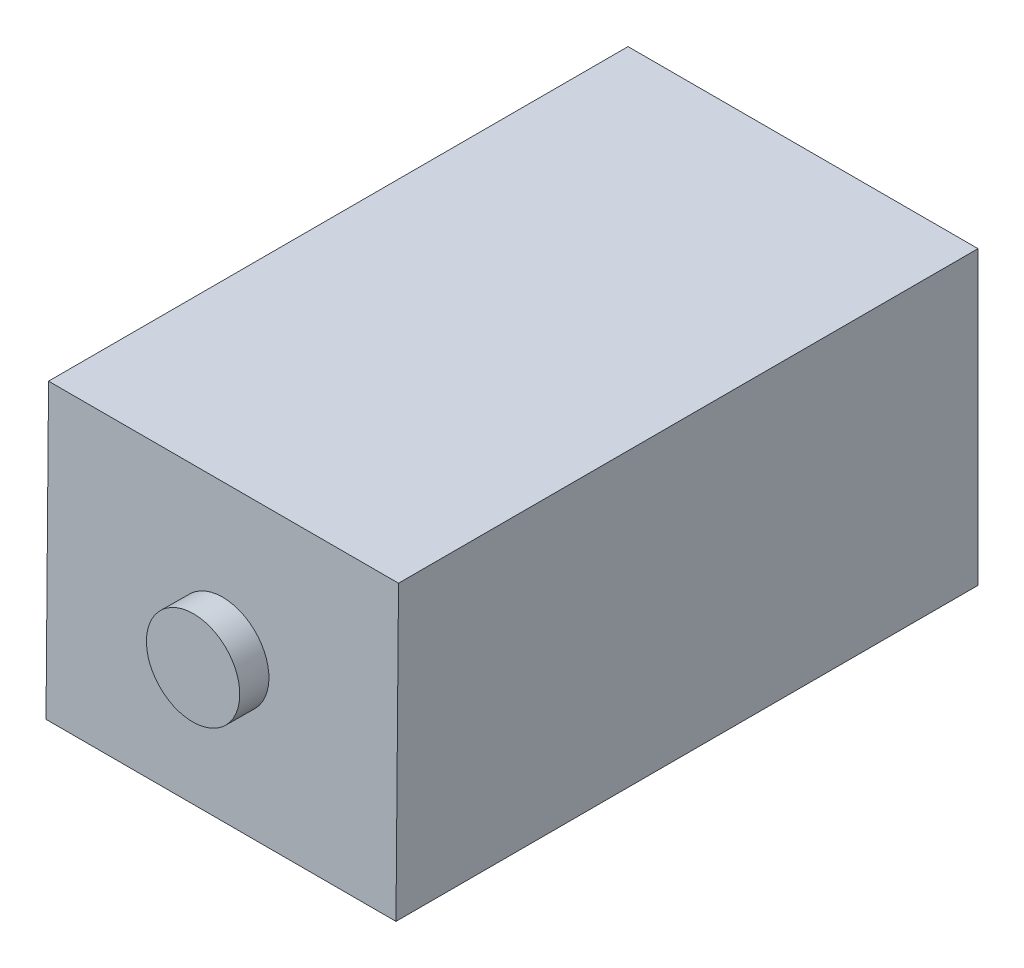
ISO-10303-21;
HEADER;
FILE_DESCRIPTION(('STEP AP214'),'2;1');
FILE_NAME('part.step','',(''),(''),'','','');
FILE_SCHEMA(('AUTOMOTIVE_DESIGN { 1 0 10303 214 1 1 1 1 }'));
ENDSEC;
DATA;
#1=APPLICATION_CONTEXT('core data for automotive mechanical design processes');
#2=APPLICATION_PROTOCOL_DEFINITION('international standard','automotive_design',2000,#1);
#3=PRODUCT_CONTEXT('',#1,'mechanical');
#4=PRODUCT('Part','Part','',(#3));
#5=PRODUCT_RELATED_PRODUCT_CATEGORY('part','',(#4));
#6=PRODUCT_DEFINITION_FORMATION('','',#4);
#7=PRODUCT_DEFINITION_CONTEXT('part definition',#1,'design');
#8=PRODUCT_DEFINITION('design','',#6,#7);
#9=PRODUCT_DEFINITION_SHAPE('','',#8);
#10=(LENGTH_UNIT() NAMED_UNIT(*) SI_UNIT(.MILLI.,.METRE.));
#11=(NAMED_UNIT(*) PLANE_ANGLE_UNIT() SI_UNIT($,.RADIAN.));
#12=(NAMED_UNIT(*) SI_UNIT($,.STERADIAN.) SOLID_ANGLE_UNIT());
#13=UNCERTAINTY_MEASURE_WITH_UNIT(LENGTH_MEASURE(1.E-05),#10,'distance_accuracy_value','');
#14=(GEOMETRIC_REPRESENTATION_CONTEXT(3) GLOBAL_UNCERTAINTY_ASSIGNED_CONTEXT((#13)) GLOBAL_UNIT_ASSIGNED_CONTEXT((#10,
#11,#12)) REPRESENTATION_CONTEXT('',''));
#15=CARTESIAN_POINT('',(0.,0.,0.));
#16=DIRECTION('',(0.,0.,1.));
#17=DIRECTION('',(1.,0.,0.));
#18=AXIS2_PLACEMENT_3D('',#15,#16,#17);
#19=CARTESIAN_POINT('',(-85.216834039375,12.4126394526767,-110.108323463438));
#20=DIRECTION('',(0.,-1.,0.));
#21=DIRECTION('',(0.,0.,-1.));
#22=AXIS2_PLACEMENT_3D('',#19,#20,#21);
#23=PLANE('',#22);
#24=DIRECTION('',(-1.,0.,0.));
#25=VECTOR('',#24,1.);
#26=CARTESIAN_POINT('',(190.,12.4126394526767,-160.));
#27=LINE('',#26,#25);
#28=CARTESIAN_POINT('',(-85.216834039375,12.4126394526767,-160.));
#29=VERTEX_POINT('',#28);
#30=CARTESIAN_POINT('',(-115.216834039375,12.4126394526767,-160.));
#31=VERTEX_POINT('',#30);
#32=EDGE_CURVE('E110',#29,#31,#27,.T.);
#33=ORIENTED_EDGE('',*,*,#32,.F.);
#34=DIRECTION('',(0.,0.,-1.));
#35=VECTOR('',#34,1.);
#36=CARTESIAN_POINT('',(-85.216834039375,12.4126394526767,-110.108323463438));
#37=LINE('',#36,#35);
#38=CARTESIAN_POINT('',(-85.216834039375,12.4126394526767,-110.108323463438));
#39=VERTEX_POINT('',#38);
#40=EDGE_CURVE('E11',#39,#29,#37,.T.);
#41=ORIENTED_EDGE('',*,*,#40,.F.);
#42=DIRECTION('',(-1.,0.,0.));
#43=VECTOR('',#42,1.);
#44=CARTESIAN_POINT('',(-135.,12.4126394526767,-110.108323463438));
#45=LINE('',#44,#43);
#46=CARTESIAN_POINT('',(-115.216834039375,12.4126394526767,-110.108323463438));
#47=VERTEX_POINT('',#46);
#48=EDGE_CURVE('E101',#47,#39,#45,.F.);
#49=ORIENTED_EDGE('',*,*,#48,.F.);
#50=DIRECTION('',(0.,0.,-1.));
#51=VECTOR('',#50,1.);
#52=CARTESIAN_POINT('',(-115.216834039375,12.4126394526767,-110.108323463438));
#53=LINE('',#52,#51);
#54=EDGE_CURVE('E48',#47,#31,#53,.T.);
#55=ORIENTED_EDGE('',*,*,#54,.T.);
#56=EDGE_LOOP('',(#33,#41,#49,#55));
#57=FACE_BOUND('',#56,.T.);
#58=ADVANCED_FACE('F39',(#57),#23,.T.);
#59=CARTESIAN_POINT('',(-85.216834039375,12.4126394526767,-110.108323463438));
#60=DIRECTION('',(1.,0.,0.));
#61=DIRECTION('',(0.,0.,-1.));
#62=AXIS2_PLACEMENT_3D('',#59,#60,#61);
#63=PLANE('',#62);
#64=DIRECTION('',(0.,-1.,0.));
#65=VECTOR('',#64,1.);
#66=CARTESIAN_POINT('',(-85.216834039375,125.,-160.));
#67=LINE('',#66,#65);
#68=CARTESIAN_POINT('',(-85.216834039375,37.411687529281,-160.));
#69=VERTEX_POINT('',#68);
#70=EDGE_CURVE('E107',#69,#29,#67,.T.);
#71=ORIENTED_EDGE('',*,*,#70,.F.);
#72=DIRECTION('',(0.,0.,-1.));
#73=VECTOR('',#72,1.);
#74=CARTESIAN_POINT('',(-85.216834039375,37.411687529281,-110.326486850897));
#75=LINE('',#74,#73);
#76=CARTESIAN_POINT('',(-85.216834039375,37.411687529281,-110.326486850897));
#77=VERTEX_POINT('',#76);
#78=EDGE_CURVE('E90',#77,#69,#75,.T.);
#79=ORIENTED_EDGE('',*,*,#78,.F.);
#80=DIRECTION('',(0.,-0.999961923064171,0.00872653549837395));
#81=VECTOR('',#80,1.);
#82=CARTESIAN_POINT('',(-85.216834039375,0.,-110.));
#83=LINE('',#82,#81);
#84=EDGE_CURVE('E97',#39,#77,#83,.F.);
#85=ORIENTED_EDGE('',*,*,#84,.F.);
#86=ORIENTED_EDGE('',*,*,#40,.T.);
#87=EDGE_LOOP('',(#71,#79,#85,#86));
#88=FACE_BOUND('',#87,.T.);
#89=ADVANCED_FACE('F143',(#88),#63,.T.);
#90=CARTESIAN_POINT('',(-115.216834039375,12.4126394526767,-110.108323463438));
#91=DIRECTION('',(-1.,0.,0.));
#92=DIRECTION('',(0.,0.,1.));
#93=AXIS2_PLACEMENT_3D('',#90,#91,#92);
#94=PLANE('',#93);
#95=DIRECTION('',(0.,1.,0.));
#96=VECTOR('',#95,1.);
#97=CARTESIAN_POINT('',(-115.216834039375,125.,-160.));
#98=LINE('',#97,#96);
#99=CARTESIAN_POINT('',(-115.216834039375,37.411687529281,-160.));
#100=VERTEX_POINT('',#99);
#101=EDGE_CURVE('E99',#31,#100,#98,.T.);
#102=ORIENTED_EDGE('',*,*,#101,.F.);
#103=ORIENTED_EDGE('',*,*,#54,.F.);
#104=DIRECTION('',(0.,0.999961923064171,-0.00872653549837395));
#105=VECTOR('',#104,1.);
#106=CARTESIAN_POINT('',(-115.216834039375,0.,-110.));
#107=LINE('',#106,#105);
#108=CARTESIAN_POINT('',(-115.216834039375,37.411687529281,-110.326486850897));
#109=VERTEX_POINT('',#108);
#110=EDGE_CURVE('E43',#109,#47,#107,.F.);
#111=ORIENTED_EDGE('',*,*,#110,.F.);
#112=DIRECTION('',(0.,0.,-1.));
#113=VECTOR('',#112,1.);
#114=CARTESIAN_POINT('',(-115.216834039375,37.411687529281,-110.326486850897));
#115=LINE('',#114,#113);
#116=EDGE_CURVE('E80',#109,#100,#115,.T.);
#117=ORIENTED_EDGE('',*,*,#116,.T.);
#118=EDGE_LOOP('',(#102,#103,#111,#117));
#119=FACE_BOUND('',#118,.T.);
#120=ADVANCED_FACE('F98',(#119),#94,.T.);
#121=CARTESIAN_POINT('',(-85.216834039375,37.411687529281,-110.326486850897));
#122=DIRECTION('',(0.,1.,0.));
#123=DIRECTION('',(0.,0.,1.));
#124=AXIS2_PLACEMENT_3D('',#121,#122,#123);
#125=PLANE('',#124);
#126=DIRECTION('',(1.,0.,0.));
#127=VECTOR('',#126,1.);
#128=CARTESIAN_POINT('',(190.,37.411687529281,-160.));
#129=LINE('',#128,#127);
#130=EDGE_CURVE('E85',#100,#69,#129,.T.);
#131=ORIENTED_EDGE('',*,*,#130,.F.);
#132=ORIENTED_EDGE('',*,*,#116,.F.);
#133=DIRECTION('',(1.,0.,0.));
#134=VECTOR('',#133,1.);
#135=CARTESIAN_POINT('',(-135.,37.411687529281,-110.326486850897));
#136=LINE('',#135,#134);
#137=EDGE_CURVE('E83',#77,#109,#136,.F.);
#138=ORIENTED_EDGE('',*,*,#137,.F.);
#139=ORIENTED_EDGE('',*,*,#78,.T.);
#140=EDGE_LOOP('',(#131,#132,#138,#139));
#141=FACE_BOUND('',#140,.T.);
#142=ADVANCED_FACE('F82',(#141),#125,.T.);
#143=CARTESIAN_POINT('',(190.,125.,-160.));
#144=DIRECTION('',(0.,0.,-1.));
#145=DIRECTION('',(-1.,0.,0.));
#146=AXIS2_PLACEMENT_3D('',#143,#144,#145);
#147=PLANE('',#146);
#148=ORIENTED_EDGE('',*,*,#32,.T.);
#149=ORIENTED_EDGE('',*,*,#101,.T.);
#150=ORIENTED_EDGE('',*,*,#130,.T.);
#151=ORIENTED_EDGE('',*,*,#70,.T.);
#152=EDGE_LOOP('',(#148,#149,#150,#151));
#153=FACE_BOUND('',#152,.T.);
#154=ADVANCED_FACE('F132',(#153),#147,.T.);
#155=CARTESIAN_POINT('',(-135.,0.,-110.));
#156=DIRECTION('',(0.,-0.00872653549837395,-0.999961923064171));
#157=DIRECTION('',(0.,0.999961923064171,-0.00872653549837395));
#158=AXIS2_PLACEMENT_3D('',#155,#156,#157);
#159=PLANE('',#158);
#160=CARTESIAN_POINT('',(-100.216834039375,24.9121634909788,-110.217405157168));
#161=DIRECTION('',(0.,-0.00872653549837395,-0.999961923064171));
#162=DIRECTION('',(0.,0.999961923064171,-0.00872653549837395));
#163=AXIS2_PLACEMENT_3D('',#160,#161,#162);
#164=CIRCLE('',#163,4.00000000000001);
#165=CARTESIAN_POINT('',(-100.216834039375,28.9120111832355,-110.252311299161));
#166=VERTEX_POINT('',#165);
#167=EDGE_CURVE('E91',#166,#166,#164,.T.);
#168=ORIENTED_EDGE('',*,*,#167,.T.);
#169=EDGE_LOOP('',(#168));
#170=FACE_BOUND('',#169,.T.);
#171=ORIENTED_EDGE('',*,*,#137,.T.);
#172=ORIENTED_EDGE('',*,*,#110,.T.);
#173=ORIENTED_EDGE('',*,*,#48,.T.);
#174=ORIENTED_EDGE('',*,*,#84,.T.);
#175=EDGE_LOOP('',(#171,#172,#173,#174));
#176=FACE_BOUND('',#175,.T.);
#177=ADVANCED_FACE('F41',(#170,#176),#159,.F.);
#178=CARTESIAN_POINT('',(0.,-0.938066015304424,-107.491718425941));
#179=DIRECTION('',(0.,0.00872653549837175,0.999961923064171));
#180=DIRECTION('',(0.,-0.999961923064171,0.00872653549837175));
#181=AXIS2_PLACEMENT_3D('',#178,#179,#180);
#182=PLANE('',#181);
#183=CARTESIAN_POINT('',(-100.216834039375,24.9339798297248,-107.717500349507));
#184=DIRECTION('',(0.,-0.00872653549837395,-0.999961923064171));
#185=DIRECTION('',(0.,0.999961923064171,-0.00872653549837395));
#186=AXIS2_PLACEMENT_3D('',#183,#184,#185);
#187=CIRCLE('',#186,4.00000000000001);
#188=CARTESIAN_POINT('',(-100.216834039375,28.9338275219815,-107.752406491501));
#189=VERTEX_POINT('',#188);
#190=EDGE_CURVE('E111',#189,#189,#187,.F.);
#191=ORIENTED_EDGE('',*,*,#190,.T.);
#192=EDGE_LOOP('',(#191));
#193=FACE_BOUND('',#192,.T.);
#194=ADVANCED_FACE('F123',(#193),#182,.T.);
#195=CARTESIAN_POINT('',(-100.216834039375,24.9557961684707,-105.217595541847));
#196=DIRECTION('',(0.,-0.00872653549837396,-0.999961923064171));
#197=DIRECTION('',(0.,0.999961923064171,-0.00872653549837396));
#198=AXIS2_PLACEMENT_3D('',#195,#196,#197);
#199=CYLINDRICAL_SURFACE('',#198,4.00000000000001);
#200=ORIENTED_EDGE('',*,*,#190,.F.);
#201=EDGE_LOOP('',(#200));
#202=FACE_BOUND('',#201,.T.);
#203=ORIENTED_EDGE('',*,*,#167,.F.);
#204=EDGE_LOOP('',(#203));
#205=FACE_BOUND('',#204,.T.);
#206=ADVANCED_FACE('F125',(#202,#205),#199,.T.);
#207=CLOSED_SHELL('',(#58,#89,#120,#142,#154,#177,#194,#206));
#208=MANIFOLD_SOLID_BREP('B2',#207);
#209=ADVANCED_BREP_SHAPE_REPRESENTATION('',(#18,#208),#14);
#210=SHAPE_DEFINITION_REPRESENTATION(#9,#209);
ENDSEC;
END-ISO-10303-21;
